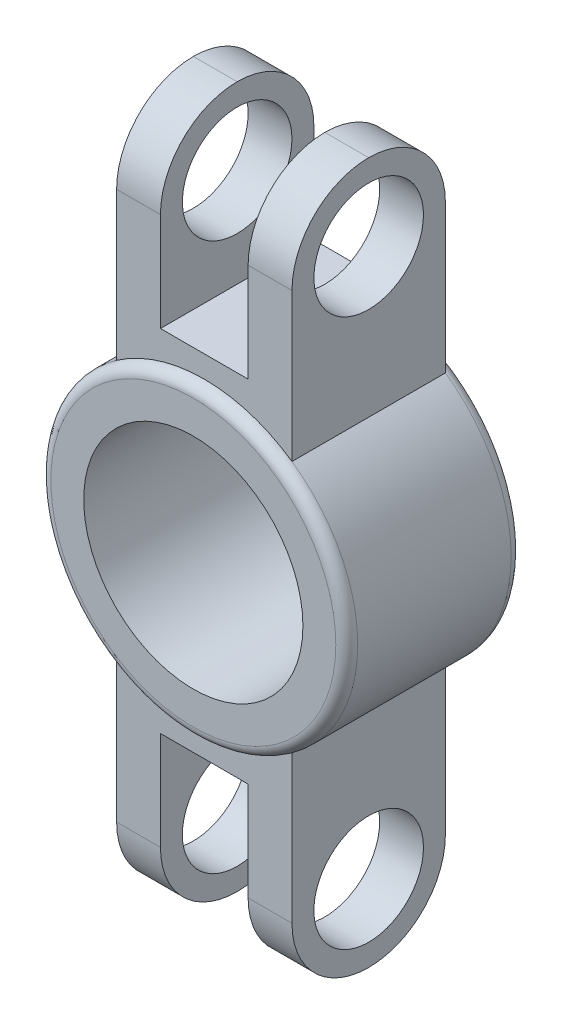
ISO-10303-21;
HEADER;
FILE_DESCRIPTION(('STEP AP214'),'2;1');
FILE_NAME('part.step','',(''),(''),'','','');
FILE_SCHEMA(('AUTOMOTIVE_DESIGN { 1 0 10303 214 1 1 1 1 }'));
ENDSEC;
DATA;
#1=APPLICATION_CONTEXT('core data for automotive mechanical design processes');
#2=APPLICATION_PROTOCOL_DEFINITION('international standard','automotive_design',2000,#1);
#3=PRODUCT_CONTEXT('',#1,'mechanical');
#4=PRODUCT('Part','Part','',(#3));
#5=PRODUCT_RELATED_PRODUCT_CATEGORY('part','',(#4));
#6=PRODUCT_DEFINITION_FORMATION('','',#4);
#7=PRODUCT_DEFINITION_CONTEXT('part definition',#1,'design');
#8=PRODUCT_DEFINITION('design','',#6,#7);
#9=PRODUCT_DEFINITION_SHAPE('','',#8);
#10=(LENGTH_UNIT() NAMED_UNIT(*) SI_UNIT(.MILLI.,.METRE.));
#11=(NAMED_UNIT(*) PLANE_ANGLE_UNIT() SI_UNIT($,.RADIAN.));
#12=(NAMED_UNIT(*) SI_UNIT($,.STERADIAN.) SOLID_ANGLE_UNIT());
#13=UNCERTAINTY_MEASURE_WITH_UNIT(LENGTH_MEASURE(1.E-05),#10,'distance_accuracy_value','');
#14=(GEOMETRIC_REPRESENTATION_CONTEXT(3) GLOBAL_UNCERTAINTY_ASSIGNED_CONTEXT((#13)) GLOBAL_UNIT_ASSIGNED_CONTEXT((#10,
#11,#12)) REPRESENTATION_CONTEXT('',''));
#15=CARTESIAN_POINT('',(0.,0.,0.));
#16=DIRECTION('',(0.,0.,1.));
#17=DIRECTION('',(1.,0.,0.));
#18=AXIS2_PLACEMENT_3D('',#15,#16,#17);
#19=CARTESIAN_POINT('',(5.08,-6.985,4.445));
#20=DIRECTION('',(-1.,0.,0.));
#21=DIRECTION('',(0.,0.,1.));
#22=AXIS2_PLACEMENT_3D('',#19,#20,#21);
#23=PLANE('',#22);
#24=CARTESIAN_POINT('',(5.08,-15.875,0.));
#25=DIRECTION('',(-1.,0.,0.));
#26=DIRECTION('',(0.,0.,1.));
#27=AXIS2_PLACEMENT_3D('',#24,#25,#26);
#28=CIRCLE('',#27,4.445);
#29=CARTESIAN_POINT('',(5.08,-15.875,4.445));
#30=VERTEX_POINT('',#29);
#31=CARTESIAN_POINT('',(5.08,-20.32,0.));
#32=VERTEX_POINT('',#31);
#33=EDGE_CURVE('E44',#30,#32,#28,.F.);
#34=ORIENTED_EDGE('',*,*,#33,.T.);
#35=CARTESIAN_POINT('',(5.08,-15.875,0.));
#36=DIRECTION('',(-1.,0.,0.));
#37=DIRECTION('',(0.,0.,1.));
#38=AXIS2_PLACEMENT_3D('',#35,#36,#37);
#39=CIRCLE('',#38,4.445);
#40=CARTESIAN_POINT('',(5.08,-15.875,-4.445));
#41=VERTEX_POINT('',#40);
#42=EDGE_CURVE('E11',#32,#41,#39,.F.);
#43=ORIENTED_EDGE('',*,*,#42,.T.);
#44=DIRECTION('',(0.,-1.,0.));
#45=VECTOR('',#44,1.);
#46=CARTESIAN_POINT('',(5.08,-6.985,-4.445));
#47=LINE('',#46,#45);
#48=CARTESIAN_POINT('',(5.08,-7.2955945611033,-4.445));
#49=VERTEX_POINT('',#48);
#50=EDGE_CURVE('E193',#49,#41,#47,.T.);
#51=ORIENTED_EDGE('',*,*,#50,.F.);
#52=DIRECTION('',(0.,0.,-1.));
#53=VECTOR('',#52,1.);
#54=CARTESIAN_POINT('',(5.08,-7.2955945611033,5.08));
#55=LINE('',#54,#53);
#56=CARTESIAN_POINT('',(5.08,-7.2955945611033,4.445));
#57=VERTEX_POINT('',#56);
#58=EDGE_CURVE('E192',#49,#57,#55,.F.);
#59=ORIENTED_EDGE('',*,*,#58,.T.);
#60=DIRECTION('',(0.,-1.,0.));
#61=VECTOR('',#60,1.);
#62=CARTESIAN_POINT('',(5.08,-6.985,4.445));
#63=LINE('',#62,#61);
#64=EDGE_CURVE('E199',#57,#30,#63,.T.);
#65=ORIENTED_EDGE('',*,*,#64,.T.);
#66=EDGE_LOOP('',(#34,#43,#51,#59,#65));
#67=FACE_BOUND('',#66,.T.);
#68=CARTESIAN_POINT('',(5.08,-15.875,0.));
#69=DIRECTION('',(-1.,0.,0.));
#70=DIRECTION('',(0.,0.,-1.));
#71=AXIS2_PLACEMENT_3D('',#68,#69,#70);
#72=CIRCLE('',#71,3.175);
#73=CARTESIAN_POINT('',(5.08,-15.875,-3.175));
#74=VERTEX_POINT('',#73);
#75=EDGE_CURVE('E348',#74,#74,#72,.T.);
#76=ORIENTED_EDGE('',*,*,#75,.T.);
#77=EDGE_LOOP('',(#76));
#78=FACE_BOUND('',#77,.T.);
#79=ADVANCED_FACE('F35',(#67,#78),#23,.F.);
#80=CARTESIAN_POINT('',(2.54,-6.985,4.445));
#81=DIRECTION('',(1.,0.,0.));
#82=DIRECTION('',(0.,0.,-1.));
#83=AXIS2_PLACEMENT_3D('',#80,#81,#82);
#84=PLANE('',#83);
#85=DIRECTION('',(0.,-1.,0.));
#86=VECTOR('',#85,1.);
#87=CARTESIAN_POINT('',(2.54,-6.985,-4.445));
#88=LINE('',#87,#86);
#89=CARTESIAN_POINT('',(2.54,-10.16,-4.445));
#90=VERTEX_POINT('',#89);
#91=CARTESIAN_POINT('',(2.54,-15.875,-4.445));
#92=VERTEX_POINT('',#91);
#93=EDGE_CURVE('E198',#90,#92,#88,.T.);
#94=ORIENTED_EDGE('',*,*,#93,.T.);
#95=CARTESIAN_POINT('',(2.54,-15.875,0.));
#96=DIRECTION('',(1.,0.,0.));
#97=DIRECTION('',(0.,0.,-1.));
#98=AXIS2_PLACEMENT_3D('',#95,#96,#97);
#99=CIRCLE('',#98,4.445);
#100=CARTESIAN_POINT('',(2.54,-20.32,0.));
#101=VERTEX_POINT('',#100);
#102=EDGE_CURVE('E58',#92,#101,#99,.F.);
#103=ORIENTED_EDGE('',*,*,#102,.T.);
#104=CARTESIAN_POINT('',(2.54,-15.875,0.));
#105=DIRECTION('',(1.,0.,0.));
#106=DIRECTION('',(0.,0.,-1.));
#107=AXIS2_PLACEMENT_3D('',#104,#105,#106);
#108=CIRCLE('',#107,4.445);
#109=CARTESIAN_POINT('',(2.54,-15.875,4.445));
#110=VERTEX_POINT('',#109);
#111=EDGE_CURVE('E197',#101,#110,#108,.F.);
#112=ORIENTED_EDGE('',*,*,#111,.T.);
#113=DIRECTION('',(0.,-1.,0.));
#114=VECTOR('',#113,1.);
#115=CARTESIAN_POINT('',(2.54,-6.985,4.445));
#116=LINE('',#115,#114);
#117=CARTESIAN_POINT('',(2.54,-10.16,4.445));
#118=VERTEX_POINT('',#117);
#119=EDGE_CURVE('E178',#118,#110,#116,.T.);
#120=ORIENTED_EDGE('',*,*,#119,.F.);
#121=DIRECTION('',(0.,0.,1.));
#122=VECTOR('',#121,1.);
#123=CARTESIAN_POINT('',(2.54,-10.16,4.445));
#124=LINE('',#123,#122);
#125=EDGE_CURVE('E188',#90,#118,#124,.T.);
#126=ORIENTED_EDGE('',*,*,#125,.F.);
#127=EDGE_LOOP('',(#94,#103,#112,#120,#126));
#128=FACE_BOUND('',#127,.T.);
#129=CARTESIAN_POINT('',(2.54,-15.875,0.));
#130=DIRECTION('',(1.,0.,0.));
#131=DIRECTION('',(0.,0.,-1.));
#132=AXIS2_PLACEMENT_3D('',#129,#130,#131);
#133=CIRCLE('',#132,3.175);
#134=CARTESIAN_POINT('',(2.54,-15.875,-3.175));
#135=VERTEX_POINT('',#134);
#136=EDGE_CURVE('E337',#135,#135,#133,.F.);
#137=ORIENTED_EDGE('',*,*,#136,.F.);
#138=EDGE_LOOP('',(#137));
#139=FACE_BOUND('',#138,.T.);
#140=ADVANCED_FACE('F195',(#128,#139),#84,.F.);
#141=CARTESIAN_POINT('',(-5.08,-6.985,4.445));
#142=DIRECTION('',(1.,0.,0.));
#143=DIRECTION('',(0.,0.,-1.));
#144=AXIS2_PLACEMENT_3D('',#141,#142,#143);
#145=PLANE('',#144);
#146=DIRECTION('',(0.,-1.,0.));
#147=VECTOR('',#146,1.);
#148=CARTESIAN_POINT('',(-5.08,-6.985,-4.445));
#149=LINE('',#148,#147);
#150=CARTESIAN_POINT('',(-5.08,-7.29559456110329,-4.445));
#151=VERTEX_POINT('',#150);
#152=CARTESIAN_POINT('',(-5.08,-15.875,-4.445));
#153=VERTEX_POINT('',#152);
#154=EDGE_CURVE('E354',#151,#153,#149,.T.);
#155=ORIENTED_EDGE('',*,*,#154,.T.);
#156=CARTESIAN_POINT('',(-5.08,-15.875,0.));
#157=DIRECTION('',(1.,0.,0.));
#158=DIRECTION('',(0.,0.,-1.));
#159=AXIS2_PLACEMENT_3D('',#156,#157,#158);
#160=CIRCLE('',#159,4.445);
#161=CARTESIAN_POINT('',(-5.08,-20.32,0.));
#162=VERTEX_POINT('',#161);
#163=EDGE_CURVE('E320',#153,#162,#160,.F.);
#164=ORIENTED_EDGE('',*,*,#163,.T.);
#165=CARTESIAN_POINT('',(-5.08,-15.875,0.));
#166=DIRECTION('',(1.,0.,0.));
#167=DIRECTION('',(0.,0.,-1.));
#168=AXIS2_PLACEMENT_3D('',#165,#166,#167);
#169=CIRCLE('',#168,4.445);
#170=CARTESIAN_POINT('',(-5.08,-15.875,4.445));
#171=VERTEX_POINT('',#170);
#172=EDGE_CURVE('E318',#162,#171,#169,.F.);
#173=ORIENTED_EDGE('',*,*,#172,.T.);
#174=DIRECTION('',(0.,-1.,0.));
#175=VECTOR('',#174,1.);
#176=CARTESIAN_POINT('',(-5.08,-6.985,4.445));
#177=LINE('',#176,#175);
#178=CARTESIAN_POINT('',(-5.08,-7.29559456110329,4.445));
#179=VERTEX_POINT('',#178);
#180=EDGE_CURVE('E357',#179,#171,#177,.T.);
#181=ORIENTED_EDGE('',*,*,#180,.F.);
#182=DIRECTION('',(0.,0.,-1.));
#183=VECTOR('',#182,1.);
#184=CARTESIAN_POINT('',(-5.08,-7.29559456110329,5.08));
#185=LINE('',#184,#183);
#186=EDGE_CURVE('E202',#179,#151,#185,.T.);
#187=ORIENTED_EDGE('',*,*,#186,.T.);
#188=EDGE_LOOP('',(#155,#164,#173,#181,#187));
#189=FACE_BOUND('',#188,.T.);
#190=CARTESIAN_POINT('',(-5.08,-15.875,0.));
#191=DIRECTION('',(-1.,0.,0.));
#192=DIRECTION('',(0.,0.,-1.));
#193=AXIS2_PLACEMENT_3D('',#190,#191,#192);
#194=CIRCLE('',#193,3.175);
#195=CARTESIAN_POINT('',(-5.08,-15.875,-3.175));
#196=VERTEX_POINT('',#195);
#197=EDGE_CURVE('E345',#196,#196,#194,.T.);
#198=ORIENTED_EDGE('',*,*,#197,.F.);
#199=EDGE_LOOP('',(#198));
#200=FACE_BOUND('',#199,.T.);
#201=ADVANCED_FACE('F383',(#189,#200),#145,.F.);
#202=CARTESIAN_POINT('',(-2.54,-6.985,4.445));
#203=DIRECTION('',(-1.,0.,0.));
#204=DIRECTION('',(0.,0.,1.));
#205=AXIS2_PLACEMENT_3D('',#202,#203,#204);
#206=PLANE('',#205);
#207=CARTESIAN_POINT('',(-2.54,-15.875,0.));
#208=DIRECTION('',(-1.,0.,0.));
#209=DIRECTION('',(0.,0.,1.));
#210=AXIS2_PLACEMENT_3D('',#207,#208,#209);
#211=CIRCLE('',#210,4.445);
#212=CARTESIAN_POINT('',(-2.54,-15.875,4.445));
#213=VERTEX_POINT('',#212);
#214=CARTESIAN_POINT('',(-2.54,-20.32,0.));
#215=VERTEX_POINT('',#214);
#216=EDGE_CURVE('E322',#213,#215,#211,.F.);
#217=ORIENTED_EDGE('',*,*,#216,.T.);
#218=CARTESIAN_POINT('',(-2.54,-15.875,0.));
#219=DIRECTION('',(-1.,0.,0.));
#220=DIRECTION('',(0.,0.,1.));
#221=AXIS2_PLACEMENT_3D('',#218,#219,#220);
#222=CIRCLE('',#221,4.445);
#223=CARTESIAN_POINT('',(-2.54,-15.875,-4.445));
#224=VERTEX_POINT('',#223);
#225=EDGE_CURVE('E324',#215,#224,#222,.F.);
#226=ORIENTED_EDGE('',*,*,#225,.T.);
#227=DIRECTION('',(0.,-1.,0.));
#228=VECTOR('',#227,1.);
#229=CARTESIAN_POINT('',(-2.54,-6.985,-4.445));
#230=LINE('',#229,#228);
#231=CARTESIAN_POINT('',(-2.54,-10.16,-4.445));
#232=VERTEX_POINT('',#231);
#233=EDGE_CURVE('E350',#232,#224,#230,.T.);
#234=ORIENTED_EDGE('',*,*,#233,.F.);
#235=DIRECTION('',(0.,0.,-1.));
#236=VECTOR('',#235,1.);
#237=CARTESIAN_POINT('',(-2.54,-10.16,4.445));
#238=LINE('',#237,#236);
#239=CARTESIAN_POINT('',(-2.54,-10.16,4.445));
#240=VERTEX_POINT('',#239);
#241=EDGE_CURVE('E353',#240,#232,#238,.T.);
#242=ORIENTED_EDGE('',*,*,#241,.F.);
#243=DIRECTION('',(0.,-1.,0.));
#244=VECTOR('',#243,1.);
#245=CARTESIAN_POINT('',(-2.54,-6.985,4.445));
#246=LINE('',#245,#244);
#247=EDGE_CURVE('E181',#240,#213,#246,.T.);
#248=ORIENTED_EDGE('',*,*,#247,.T.);
#249=EDGE_LOOP('',(#217,#226,#234,#242,#248));
#250=FACE_BOUND('',#249,.T.);
#251=CARTESIAN_POINT('',(-2.54,-15.875,0.));
#252=DIRECTION('',(-1.,0.,0.));
#253=DIRECTION('',(0.,0.,1.));
#254=AXIS2_PLACEMENT_3D('',#251,#252,#253);
#255=CIRCLE('',#254,3.175);
#256=CARTESIAN_POINT('',(-2.54,-15.875,3.175));
#257=VERTEX_POINT('',#256);
#258=EDGE_CURVE('E39',#257,#257,#255,.F.);
#259=ORIENTED_EDGE('',*,*,#258,.F.);
#260=EDGE_LOOP('',(#259));
#261=FACE_BOUND('',#260,.T.);
#262=ADVANCED_FACE('F385',(#250,#261),#206,.F.);
#263=CARTESIAN_POINT('',(3.81,-10.16,4.445));
#264=DIRECTION('',(0.,-1.,0.));
#265=DIRECTION('',(0.,0.,-1.));
#266=AXIS2_PLACEMENT_3D('',#263,#264,#265);
#267=PLANE('',#266);
#268=DIRECTION('',(-1.,0.,0.));
#269=VECTOR('',#268,1.);
#270=CARTESIAN_POINT('',(3.81,-10.16,4.445));
#271=LINE('',#270,#269);
#272=EDGE_CURVE('E173',#118,#240,#271,.T.);
#273=ORIENTED_EDGE('',*,*,#272,.T.);
#274=ORIENTED_EDGE('',*,*,#241,.T.);
#275=DIRECTION('',(-1.,0.,0.));
#276=VECTOR('',#275,1.);
#277=CARTESIAN_POINT('',(3.81,-10.16,-4.445));
#278=LINE('',#277,#276);
#279=EDGE_CURVE('E185',#90,#232,#278,.T.);
#280=ORIENTED_EDGE('',*,*,#279,.F.);
#281=ORIENTED_EDGE('',*,*,#125,.T.);
#282=EDGE_LOOP('',(#273,#274,#280,#281));
#283=FACE_BOUND('',#282,.T.);
#284=ADVANCED_FACE('F189',(#283),#267,.T.);
#285=CARTESIAN_POINT('',(0.,0.,5.08));
#286=DIRECTION('',(0.,0.,-1.));
#287=DIRECTION('',(-1.,0.,0.));
#288=AXIS2_PLACEMENT_3D('',#285,#286,#287);
#289=CYLINDRICAL_SURFACE('',#288,8.89);
#290=ORIENTED_EDGE('',*,*,#186,.F.);
#291=CARTESIAN_POINT('',(0.,0.,4.445));
#292=DIRECTION('',(0.,0.,1.));
#293=DIRECTION('',(1.,0.,0.));
#294=AXIS2_PLACEMENT_3D('',#291,#292,#293);
#295=CIRCLE('',#294,8.89);
#296=CARTESIAN_POINT('',(-5.08,7.29559456110329,4.445));
#297=VERTEX_POINT('',#296);
#298=EDGE_CURVE('E259',#179,#297,#295,.F.);
#299=ORIENTED_EDGE('',*,*,#298,.T.);
#300=DIRECTION('',(0.,0.,-1.));
#301=VECTOR('',#300,1.);
#302=CARTESIAN_POINT('',(-5.08,7.29559456110329,5.08));
#303=LINE('',#302,#301);
#304=CARTESIAN_POINT('',(-5.08,7.29559456110329,-4.445));
#305=VERTEX_POINT('',#304);
#306=EDGE_CURVE('E222',#297,#305,#303,.T.);
#307=ORIENTED_EDGE('',*,*,#306,.T.);
#308=CARTESIAN_POINT('',(0.,0.,-4.445));
#309=DIRECTION('',(0.,0.,1.));
#310=DIRECTION('',(1.,0.,0.));
#311=AXIS2_PLACEMENT_3D('',#308,#309,#310);
#312=CIRCLE('',#311,8.89);
#313=EDGE_CURVE('E269',#305,#151,#312,.T.);
#314=ORIENTED_EDGE('',*,*,#313,.T.);
#315=EDGE_LOOP('',(#290,#299,#307,#314));
#316=FACE_BOUND('',#315,.T.);
#317=ADVANCED_FACE('F403',(#316),#289,.T.);
#318=ORIENTED_EDGE('',*,*,#58,.F.);
#319=CARTESIAN_POINT('',(5.08,7.2955945611033,-4.445));
#320=VERTEX_POINT('',#319);
#321=EDGE_CURVE('E264',#49,#320,#312,.T.);
#322=ORIENTED_EDGE('',*,*,#321,.T.);
#323=DIRECTION('',(0.,0.,-1.));
#324=VECTOR('',#323,1.);
#325=CARTESIAN_POINT('',(5.08,7.2955945611033,5.08));
#326=LINE('',#325,#324);
#327=CARTESIAN_POINT('',(5.08,7.2955945611033,4.445));
#328=VERTEX_POINT('',#327);
#329=EDGE_CURVE('E239',#320,#328,#326,.F.);
#330=ORIENTED_EDGE('',*,*,#329,.T.);
#331=EDGE_CURVE('E265',#328,#57,#295,.F.);
#332=ORIENTED_EDGE('',*,*,#331,.T.);
#333=EDGE_LOOP('',(#318,#322,#330,#332));
#334=FACE_BOUND('',#333,.T.);
#335=ADVANCED_FACE('F451',(#334),#289,.T.);
#336=CARTESIAN_POINT('',(0.,0.,5.08));
#337=DIRECTION('',(0.,0.,1.));
#338=DIRECTION('',(1.,0.,0.));
#339=AXIS2_PLACEMENT_3D('',#336,#337,#338);
#340=PLANE('',#339);
#341=CARTESIAN_POINT('',(0.,0.,5.08));
#342=DIRECTION('',(0.,0.,1.));
#343=DIRECTION('',(1.,0.,0.));
#344=AXIS2_PLACEMENT_3D('',#341,#342,#343);
#345=CIRCLE('',#344,8.255);
#346=CARTESIAN_POINT('',(8.255,0.,5.08));
#347=VERTEX_POINT('',#346);
#348=EDGE_CURVE('E272',#347,#347,#345,.T.);
#349=ORIENTED_EDGE('',*,*,#348,.T.);
#350=EDGE_LOOP('',(#349));
#351=FACE_BOUND('',#350,.T.);
#352=CARTESIAN_POINT('',(0.,0.,5.08));
#353=DIRECTION('',(0.,0.,1.));
#354=DIRECTION('',(1.,0.,0.));
#355=AXIS2_PLACEMENT_3D('',#352,#353,#354);
#356=CIRCLE('',#355,6.35);
#357=CARTESIAN_POINT('',(6.35,0.,5.08));
#358=VERTEX_POINT('',#357);
#359=EDGE_CURVE('E256',#358,#358,#356,.T.);
#360=ORIENTED_EDGE('',*,*,#359,.F.);
#361=EDGE_LOOP('',(#360));
#362=FACE_BOUND('',#361,.T.);
#363=ADVANCED_FACE('F448',(#351,#362),#340,.T.);
#364=CARTESIAN_POINT('',(0.,0.,-5.08));
#365=DIRECTION('',(0.,0.,1.));
#366=DIRECTION('',(1.,0.,0.));
#367=AXIS2_PLACEMENT_3D('',#364,#365,#366);
#368=PLANE('',#367);
#369=CARTESIAN_POINT('',(0.,0.,-5.08));
#370=DIRECTION('',(0.,0.,1.));
#371=DIRECTION('',(1.,0.,0.));
#372=AXIS2_PLACEMENT_3D('',#369,#370,#371);
#373=CIRCLE('',#372,8.255);
#374=CARTESIAN_POINT('',(8.255,0.,-5.08));
#375=VERTEX_POINT('',#374);
#376=EDGE_CURVE('E268',#375,#375,#373,.F.);
#377=ORIENTED_EDGE('',*,*,#376,.T.);
#378=EDGE_LOOP('',(#377));
#379=FACE_BOUND('',#378,.T.);
#380=CARTESIAN_POINT('',(0.,0.,-5.08));
#381=DIRECTION('',(0.,0.,1.));
#382=DIRECTION('',(1.,0.,0.));
#383=AXIS2_PLACEMENT_3D('',#380,#381,#382);
#384=CIRCLE('',#383,6.35);
#385=CARTESIAN_POINT('',(6.35,0.,-5.08));
#386=VERTEX_POINT('',#385);
#387=EDGE_CURVE('E255',#386,#386,#384,.T.);
#388=ORIENTED_EDGE('',*,*,#387,.T.);
#389=EDGE_LOOP('',(#388));
#390=FACE_BOUND('',#389,.T.);
#391=ADVANCED_FACE('F446',(#379,#390),#368,.F.);
#392=CARTESIAN_POINT('',(0.,0.,5.08));
#393=DIRECTION('',(0.,0.,-1.));
#394=DIRECTION('',(-1.,0.,0.));
#395=AXIS2_PLACEMENT_3D('',#392,#393,#394);
#396=CYLINDRICAL_SURFACE('',#395,6.35);
#397=ORIENTED_EDGE('',*,*,#359,.T.);
#398=EDGE_LOOP('',(#397));
#399=FACE_BOUND('',#398,.T.);
#400=ORIENTED_EDGE('',*,*,#387,.F.);
#401=EDGE_LOOP('',(#400));
#402=FACE_BOUND('',#401,.T.);
#403=ADVANCED_FACE('F442',(#399,#402),#396,.F.);
#404=CARTESIAN_POINT('',(0.,0.,-4.445));
#405=DIRECTION('',(0.,0.,1.));
#406=DIRECTION('',(1.,0.,0.));
#407=AXIS2_PLACEMENT_3D('',#404,#405,#406);
#408=TOROIDAL_SURFACE('',#407,8.255,0.635);
#409=ORIENTED_EDGE('',*,*,#376,.F.);
#410=EDGE_LOOP('',(#409));
#411=FACE_BOUND('',#410,.T.);
#412=EDGE_CURVE('E266',#320,#305,#312,.T.);
#413=ORIENTED_EDGE('',*,*,#412,.F.);
#414=ORIENTED_EDGE('',*,*,#321,.F.);
#415=EDGE_CURVE('E368',#151,#49,#312,.T.);
#416=ORIENTED_EDGE('',*,*,#415,.F.);
#417=ORIENTED_EDGE('',*,*,#313,.F.);
#418=EDGE_LOOP('',(#413,#414,#416,#417));
#419=FACE_BOUND('',#418,.T.);
#420=ADVANCED_FACE('F445',(#411,#419),#408,.T.);
#421=CARTESIAN_POINT('',(0.,0.,4.445));
#422=DIRECTION('',(0.,0.,1.));
#423=DIRECTION('',(1.,0.,0.));
#424=AXIS2_PLACEMENT_3D('',#421,#422,#423);
#425=TOROIDAL_SURFACE('',#424,8.255,0.635);
#426=EDGE_CURVE('E262',#297,#328,#295,.F.);
#427=ORIENTED_EDGE('',*,*,#426,.F.);
#428=ORIENTED_EDGE('',*,*,#298,.F.);
#429=EDGE_CURVE('E517',#57,#179,#295,.F.);
#430=ORIENTED_EDGE('',*,*,#429,.F.);
#431=ORIENTED_EDGE('',*,*,#331,.F.);
#432=EDGE_LOOP('',(#427,#428,#430,#431));
#433=FACE_BOUND('',#432,.T.);
#434=ORIENTED_EDGE('',*,*,#348,.F.);
#435=EDGE_LOOP('',(#434));
#436=FACE_BOUND('',#435,.T.);
#437=ADVANCED_FACE('F440',(#433,#436),#425,.T.);
#438=CARTESIAN_POINT('',(3.81,6.35,4.445));
#439=DIRECTION('',(0.,0.,-1.));
#440=DIRECTION('',(-1.,0.,0.));
#441=AXIS2_PLACEMENT_3D('',#438,#439,#440);
#442=PLANE('',#441);
#443=DIRECTION('',(0.,1.,0.));
#444=VECTOR('',#443,1.);
#445=CARTESIAN_POINT('',(-2.54,6.985,4.445));
#446=LINE('',#445,#444);
#447=CARTESIAN_POINT('',(-2.54,10.16,4.445));
#448=VERTEX_POINT('',#447);
#449=CARTESIAN_POINT('',(-2.54,15.875,4.445));
#450=VERTEX_POINT('',#449);
#451=EDGE_CURVE('E219',#448,#450,#446,.T.);
#452=ORIENTED_EDGE('',*,*,#451,.T.);
#453=DIRECTION('',(1.,0.,0.));
#454=VECTOR('',#453,1.);
#455=CARTESIAN_POINT('',(3.81,15.875,4.445));
#456=LINE('',#455,#454);
#457=CARTESIAN_POINT('',(-5.08,15.875,4.445));
#458=VERTEX_POINT('',#457);
#459=EDGE_CURVE('E296',#450,#458,#456,.F.);
#460=ORIENTED_EDGE('',*,*,#459,.T.);
#461=DIRECTION('',(0.,1.,0.));
#462=VECTOR('',#461,1.);
#463=CARTESIAN_POINT('',(-5.08,6.985,4.445));
#464=LINE('',#463,#462);
#465=EDGE_CURVE('E223',#297,#458,#464,.T.);
#466=ORIENTED_EDGE('',*,*,#465,.F.);
#467=ORIENTED_EDGE('',*,*,#426,.T.);
#468=DIRECTION('',(0.,1.,0.));
#469=VECTOR('',#468,1.);
#470=CARTESIAN_POINT('',(5.08,6.985,4.445));
#471=LINE('',#470,#469);
#472=CARTESIAN_POINT('',(5.08,15.875,4.445));
#473=VERTEX_POINT('',#472);
#474=EDGE_CURVE('E236',#328,#473,#471,.T.);
#475=ORIENTED_EDGE('',*,*,#474,.T.);
#476=DIRECTION('',(1.,0.,0.));
#477=VECTOR('',#476,1.);
#478=CARTESIAN_POINT('',(3.81,15.875,4.445));
#479=LINE('',#478,#477);
#480=CARTESIAN_POINT('',(2.54,15.875,4.445));
#481=VERTEX_POINT('',#480);
#482=EDGE_CURVE('E294',#473,#481,#479,.F.);
#483=ORIENTED_EDGE('',*,*,#482,.T.);
#484=DIRECTION('',(0.,1.,0.));
#485=VECTOR('',#484,1.);
#486=CARTESIAN_POINT('',(2.54,6.985,4.445));
#487=LINE('',#486,#485);
#488=CARTESIAN_POINT('',(2.54,10.16,4.445));
#489=VERTEX_POINT('',#488);
#490=EDGE_CURVE('E240',#489,#481,#487,.T.);
#491=ORIENTED_EDGE('',*,*,#490,.F.);
#492=DIRECTION('',(-1.,0.,0.));
#493=VECTOR('',#492,1.);
#494=CARTESIAN_POINT('',(3.81,10.16,4.445));
#495=LINE('',#494,#493);
#496=EDGE_CURVE('E250',#489,#448,#495,.T.);
#497=ORIENTED_EDGE('',*,*,#496,.T.);
#498=EDGE_LOOP('',(#452,#460,#466,#467,#475,#483,#491,#497));
#499=FACE_BOUND('',#498,.T.);
#500=ADVANCED_FACE('F436',(#499),#442,.F.);
#501=CARTESIAN_POINT('',(3.81,6.35,-4.445));
#502=DIRECTION('',(0.,0.,1.));
#503=DIRECTION('',(1.,0.,0.));
#504=AXIS2_PLACEMENT_3D('',#501,#502,#503);
#505=PLANE('',#504);
#506=DIRECTION('',(0.,1.,0.));
#507=VECTOR('',#506,1.);
#508=CARTESIAN_POINT('',(-5.08,6.985,-4.445));
#509=LINE('',#508,#507);
#510=CARTESIAN_POINT('',(-5.08,15.875,-4.445));
#511=VERTEX_POINT('',#510);
#512=EDGE_CURVE('E226',#305,#511,#509,.T.);
#513=ORIENTED_EDGE('',*,*,#512,.T.);
#514=DIRECTION('',(-1.,0.,0.));
#515=VECTOR('',#514,1.);
#516=CARTESIAN_POINT('',(3.81,15.875,-4.445));
#517=LINE('',#516,#515);
#518=CARTESIAN_POINT('',(-2.54,15.875,-4.445));
#519=VERTEX_POINT('',#518);
#520=EDGE_CURVE('E287',#511,#519,#517,.F.);
#521=ORIENTED_EDGE('',*,*,#520,.T.);
#522=DIRECTION('',(0.,1.,0.));
#523=VECTOR('',#522,1.);
#524=CARTESIAN_POINT('',(-2.54,6.985,-4.445));
#525=LINE('',#524,#523);
#526=CARTESIAN_POINT('',(-2.54,10.16,-4.445));
#527=VERTEX_POINT('',#526);
#528=EDGE_CURVE('E229',#527,#519,#525,.T.);
#529=ORIENTED_EDGE('',*,*,#528,.F.);
#530=DIRECTION('',(-1.,0.,0.));
#531=VECTOR('',#530,1.);
#532=CARTESIAN_POINT('',(3.81,10.16,-4.445));
#533=LINE('',#532,#531);
#534=CARTESIAN_POINT('',(2.54,10.16,-4.445));
#535=VERTEX_POINT('',#534);
#536=EDGE_CURVE('E253',#535,#527,#533,.T.);
#537=ORIENTED_EDGE('',*,*,#536,.F.);
#538=DIRECTION('',(0.,1.,0.));
#539=VECTOR('',#538,1.);
#540=CARTESIAN_POINT('',(2.54,6.985,-4.445));
#541=LINE('',#540,#539);
#542=CARTESIAN_POINT('',(2.54,15.875,-4.445));
#543=VERTEX_POINT('',#542);
#544=EDGE_CURVE('E243',#535,#543,#541,.T.);
#545=ORIENTED_EDGE('',*,*,#544,.T.);
#546=DIRECTION('',(-1.,0.,0.));
#547=VECTOR('',#546,1.);
#548=CARTESIAN_POINT('',(3.81,15.875,-4.445));
#549=LINE('',#548,#547);
#550=CARTESIAN_POINT('',(5.08,15.875,-4.445));
#551=VERTEX_POINT('',#550);
#552=EDGE_CURVE('E284',#543,#551,#549,.F.);
#553=ORIENTED_EDGE('',*,*,#552,.T.);
#554=DIRECTION('',(0.,1.,0.));
#555=VECTOR('',#554,1.);
#556=CARTESIAN_POINT('',(5.08,6.985,-4.445));
#557=LINE('',#556,#555);
#558=EDGE_CURVE('E235',#320,#551,#557,.T.);
#559=ORIENTED_EDGE('',*,*,#558,.F.);
#560=ORIENTED_EDGE('',*,*,#412,.T.);
#561=EDGE_LOOP('',(#513,#521,#529,#537,#545,#553,#559,#560));
#562=FACE_BOUND('',#561,.T.);
#563=ADVANCED_FACE('F432',(#562),#505,.F.);
#564=CARTESIAN_POINT('',(3.81,10.16,4.445));
#565=DIRECTION('',(0.,-1.,0.));
#566=DIRECTION('',(0.,0.,-1.));
#567=AXIS2_PLACEMENT_3D('',#564,#565,#566);
#568=PLANE('',#567);
#569=ORIENTED_EDGE('',*,*,#536,.T.);
#570=DIRECTION('',(0.,0.,1.));
#571=VECTOR('',#570,1.);
#572=CARTESIAN_POINT('',(-2.54,10.16,4.445));
#573=LINE('',#572,#571);
#574=EDGE_CURVE('E278',#527,#448,#573,.T.);
#575=ORIENTED_EDGE('',*,*,#574,.T.);
#576=ORIENTED_EDGE('',*,*,#496,.F.);
#577=DIRECTION('',(0.,0.,-1.));
#578=VECTOR('',#577,1.);
#579=CARTESIAN_POINT('',(2.54,10.16,4.445));
#580=LINE('',#579,#578);
#581=EDGE_CURVE('E275',#489,#535,#580,.T.);
#582=ORIENTED_EDGE('',*,*,#581,.T.);
#583=EDGE_LOOP('',(#569,#575,#576,#582));
#584=FACE_BOUND('',#583,.T.);
#585=ADVANCED_FACE('F428',(#584),#568,.F.);
#586=CARTESIAN_POINT('',(5.08,6.985,4.445));
#587=DIRECTION('',(1.,0.,0.));
#588=DIRECTION('',(0.,0.,-1.));
#589=AXIS2_PLACEMENT_3D('',#586,#587,#588);
#590=PLANE('',#589);
#591=CARTESIAN_POINT('',(5.08,15.875,0.));
#592=DIRECTION('',(1.,0.,0.));
#593=DIRECTION('',(0.,0.,-1.));
#594=AXIS2_PLACEMENT_3D('',#591,#592,#593);
#595=CIRCLE('',#594,3.175);
#596=CARTESIAN_POINT('',(5.08,15.875,-3.175));
#597=VERTEX_POINT('',#596);
#598=EDGE_CURVE('E184',#597,#597,#595,.T.);
#599=ORIENTED_EDGE('',*,*,#598,.F.);
#600=EDGE_LOOP('',(#599));
#601=FACE_BOUND('',#600,.T.);
#602=ORIENTED_EDGE('',*,*,#558,.T.);
#603=CARTESIAN_POINT('',(5.08,15.875,0.));
#604=DIRECTION('',(1.,0.,0.));
#605=DIRECTION('',(0.,0.,-1.));
#606=AXIS2_PLACEMENT_3D('',#603,#604,#605);
#607=CIRCLE('',#606,4.445);
#608=CARTESIAN_POINT('',(5.08,20.32,0.));
#609=VERTEX_POINT('',#608);
#610=EDGE_CURVE('E304',#551,#609,#607,.T.);
#611=ORIENTED_EDGE('',*,*,#610,.T.);
#612=CARTESIAN_POINT('',(5.08,15.875,0.));
#613=DIRECTION('',(1.,0.,0.));
#614=DIRECTION('',(0.,0.,-1.));
#615=AXIS2_PLACEMENT_3D('',#612,#613,#614);
#616=CIRCLE('',#615,4.445);
#617=EDGE_CURVE('E302',#609,#473,#616,.T.);
#618=ORIENTED_EDGE('',*,*,#617,.T.);
#619=ORIENTED_EDGE('',*,*,#474,.F.);
#620=ORIENTED_EDGE('',*,*,#329,.F.);
#621=EDGE_LOOP('',(#602,#611,#618,#619,#620));
#622=FACE_BOUND('',#621,.T.);
#623=ADVANCED_FACE('F424',(#601,#622),#590,.T.);
#624=CARTESIAN_POINT('',(2.54,6.985,4.445));
#625=DIRECTION('',(-1.,0.,0.));
#626=DIRECTION('',(0.,0.,1.));
#627=AXIS2_PLACEMENT_3D('',#624,#625,#626);
#628=PLANE('',#627);
#629=CARTESIAN_POINT('',(2.54,15.875,0.));
#630=DIRECTION('',(-1.,0.,0.));
#631=DIRECTION('',(0.,0.,1.));
#632=AXIS2_PLACEMENT_3D('',#629,#630,#631);
#633=CIRCLE('',#632,3.175);
#634=CARTESIAN_POINT('',(2.54,15.875,3.175));
#635=VERTEX_POINT('',#634);
#636=EDGE_CURVE('E215',#635,#635,#633,.T.);
#637=ORIENTED_EDGE('',*,*,#636,.F.);
#638=EDGE_LOOP('',(#637));
#639=FACE_BOUND('',#638,.T.);
#640=CARTESIAN_POINT('',(2.54,15.875,0.));
#641=DIRECTION('',(-1.,0.,0.));
#642=DIRECTION('',(0.,0.,1.));
#643=AXIS2_PLACEMENT_3D('',#640,#641,#642);
#644=CIRCLE('',#643,4.445);
#645=CARTESIAN_POINT('',(2.54,20.32,0.));
#646=VERTEX_POINT('',#645);
#647=EDGE_CURVE('E298',#481,#646,#644,.T.);
#648=ORIENTED_EDGE('',*,*,#647,.T.);
#649=CARTESIAN_POINT('',(2.54,15.875,0.));
#650=DIRECTION('',(-1.,0.,0.));
#651=DIRECTION('',(0.,0.,1.));
#652=AXIS2_PLACEMENT_3D('',#649,#650,#651);
#653=CIRCLE('',#652,4.445);
#654=EDGE_CURVE('E300',#646,#543,#653,.T.);
#655=ORIENTED_EDGE('',*,*,#654,.T.);
#656=ORIENTED_EDGE('',*,*,#544,.F.);
#657=ORIENTED_EDGE('',*,*,#581,.F.);
#658=ORIENTED_EDGE('',*,*,#490,.T.);
#659=EDGE_LOOP('',(#648,#655,#656,#657,#658));
#660=FACE_BOUND('',#659,.T.);
#661=ADVANCED_FACE('F416',(#639,#660),#628,.T.);
#662=CARTESIAN_POINT('',(-5.08,6.985,4.445));
#663=DIRECTION('',(-1.,0.,0.));
#664=DIRECTION('',(0.,0.,1.));
#665=AXIS2_PLACEMENT_3D('',#662,#663,#664);
#666=PLANE('',#665);
#667=CARTESIAN_POINT('',(-5.08,15.875,0.));
#668=DIRECTION('',(1.,0.,0.));
#669=DIRECTION('',(0.,0.,-1.));
#670=AXIS2_PLACEMENT_3D('',#667,#668,#669);
#671=CIRCLE('',#670,3.175);
#672=CARTESIAN_POINT('',(-5.08,15.875,-3.175));
#673=VERTEX_POINT('',#672);
#674=EDGE_CURVE('E209',#673,#673,#671,.T.);
#675=ORIENTED_EDGE('',*,*,#674,.T.);
#676=EDGE_LOOP('',(#675));
#677=FACE_BOUND('',#676,.T.);
#678=CARTESIAN_POINT('',(-5.08,15.875,0.));
#679=DIRECTION('',(-1.,0.,0.));
#680=DIRECTION('',(0.,0.,1.));
#681=AXIS2_PLACEMENT_3D('',#678,#679,#680);
#682=CIRCLE('',#681,4.445);
#683=CARTESIAN_POINT('',(-5.08,20.32,0.));
#684=VERTEX_POINT('',#683);
#685=EDGE_CURVE('E280',#458,#684,#682,.T.);
#686=ORIENTED_EDGE('',*,*,#685,.T.);
#687=CARTESIAN_POINT('',(-5.08,15.875,0.));
#688=DIRECTION('',(-1.,0.,0.));
#689=DIRECTION('',(0.,0.,1.));
#690=AXIS2_PLACEMENT_3D('',#687,#688,#689);
#691=CIRCLE('',#690,4.445);
#692=EDGE_CURVE('E282',#684,#511,#691,.T.);
#693=ORIENTED_EDGE('',*,*,#692,.T.);
#694=ORIENTED_EDGE('',*,*,#512,.F.);
#695=ORIENTED_EDGE('',*,*,#306,.F.);
#696=ORIENTED_EDGE('',*,*,#465,.T.);
#697=EDGE_LOOP('',(#686,#693,#694,#695,#696));
#698=FACE_BOUND('',#697,.T.);
#699=ADVANCED_FACE('F412',(#677,#698),#666,.T.);
#700=CARTESIAN_POINT('',(-2.54,6.985,4.445));
#701=DIRECTION('',(1.,0.,0.));
#702=DIRECTION('',(0.,0.,-1.));
#703=AXIS2_PLACEMENT_3D('',#700,#701,#702);
#704=PLANE('',#703);
#705=CARTESIAN_POINT('',(-2.54,15.875,0.));
#706=DIRECTION('',(1.,0.,0.));
#707=DIRECTION('',(0.,0.,-1.));
#708=AXIS2_PLACEMENT_3D('',#705,#706,#707);
#709=CIRCLE('',#708,3.175);
#710=CARTESIAN_POINT('',(-2.54,15.875,-3.175));
#711=VERTEX_POINT('',#710);
#712=EDGE_CURVE('E212',#711,#711,#709,.T.);
#713=ORIENTED_EDGE('',*,*,#712,.F.);
#714=EDGE_LOOP('',(#713));
#715=FACE_BOUND('',#714,.T.);
#716=ORIENTED_EDGE('',*,*,#528,.T.);
#717=CARTESIAN_POINT('',(-2.54,15.875,0.));
#718=DIRECTION('',(1.,0.,0.));
#719=DIRECTION('',(0.,0.,-1.));
#720=AXIS2_PLACEMENT_3D('',#717,#718,#719);
#721=CIRCLE('',#720,4.445);
#722=CARTESIAN_POINT('',(-2.54,20.32,0.));
#723=VERTEX_POINT('',#722);
#724=EDGE_CURVE('E292',#519,#723,#721,.T.);
#725=ORIENTED_EDGE('',*,*,#724,.T.);
#726=CARTESIAN_POINT('',(-2.54,15.875,0.));
#727=DIRECTION('',(1.,0.,0.));
#728=DIRECTION('',(0.,0.,-1.));
#729=AXIS2_PLACEMENT_3D('',#726,#727,#728);
#730=CIRCLE('',#729,4.445);
#731=EDGE_CURVE('E290',#723,#450,#730,.T.);
#732=ORIENTED_EDGE('',*,*,#731,.T.);
#733=ORIENTED_EDGE('',*,*,#451,.F.);
#734=ORIENTED_EDGE('',*,*,#574,.F.);
#735=EDGE_LOOP('',(#716,#725,#732,#733,#734));
#736=FACE_BOUND('',#735,.T.);
#737=ADVANCED_FACE('F415',(#715,#736),#704,.T.);
#738=CARTESIAN_POINT('',(0.,15.875,0.));
#739=DIRECTION('',(1.,0.,0.));
#740=DIRECTION('',(0.,0.,-1.));
#741=AXIS2_PLACEMENT_3D('',#738,#739,#740);
#742=CYLINDRICAL_SURFACE('',#741,4.445);
#743=ORIENTED_EDGE('',*,*,#459,.F.);
#744=ORIENTED_EDGE('',*,*,#731,.F.);
#745=DIRECTION('',(1.,0.,0.));
#746=VECTOR('',#745,1.);
#747=CARTESIAN_POINT('',(0.,20.32,0.));
#748=LINE('',#747,#746);
#749=EDGE_CURVE('E232',#684,#723,#748,.T.);
#750=ORIENTED_EDGE('',*,*,#749,.F.);
#751=ORIENTED_EDGE('',*,*,#685,.F.);
#752=EDGE_LOOP('',(#743,#744,#750,#751));
#753=FACE_BOUND('',#752,.T.);
#754=ADVANCED_FACE('F420',(#753),#742,.T.);
#755=CARTESIAN_POINT('',(0.,15.875,0.));
#756=DIRECTION('',(-1.,0.,0.));
#757=DIRECTION('',(0.,0.,1.));
#758=AXIS2_PLACEMENT_3D('',#755,#756,#757);
#759=CYLINDRICAL_SURFACE('',#758,4.445);
#760=ORIENTED_EDGE('',*,*,#724,.F.);
#761=ORIENTED_EDGE('',*,*,#520,.F.);
#762=ORIENTED_EDGE('',*,*,#692,.F.);
#763=ORIENTED_EDGE('',*,*,#749,.T.);
#764=EDGE_LOOP('',(#760,#761,#762,#763));
#765=FACE_BOUND('',#764,.T.);
#766=ADVANCED_FACE('F465',(#765),#759,.T.);
#767=CARTESIAN_POINT('',(0.,15.875,0.));
#768=DIRECTION('',(1.,0.,0.));
#769=DIRECTION('',(0.,0.,-1.));
#770=AXIS2_PLACEMENT_3D('',#767,#768,#769);
#771=CYLINDRICAL_SURFACE('',#770,4.445);
#772=ORIENTED_EDGE('',*,*,#482,.F.);
#773=ORIENTED_EDGE('',*,*,#617,.F.);
#774=DIRECTION('',(1.,0.,0.));
#775=VECTOR('',#774,1.);
#776=CARTESIAN_POINT('',(0.,20.32,0.));
#777=LINE('',#776,#775);
#778=EDGE_CURVE('E218',#646,#609,#777,.T.);
#779=ORIENTED_EDGE('',*,*,#778,.F.);
#780=ORIENTED_EDGE('',*,*,#647,.F.);
#781=EDGE_LOOP('',(#772,#773,#779,#780));
#782=FACE_BOUND('',#781,.T.);
#783=ADVANCED_FACE('F468',(#782),#771,.T.);
#784=CARTESIAN_POINT('',(0.,15.875,0.));
#785=DIRECTION('',(-1.,0.,0.));
#786=DIRECTION('',(0.,0.,1.));
#787=AXIS2_PLACEMENT_3D('',#784,#785,#786);
#788=CYLINDRICAL_SURFACE('',#787,4.445);
#789=ORIENTED_EDGE('',*,*,#610,.F.);
#790=ORIENTED_EDGE('',*,*,#552,.F.);
#791=ORIENTED_EDGE('',*,*,#654,.F.);
#792=ORIENTED_EDGE('',*,*,#778,.T.);
#793=EDGE_LOOP('',(#789,#790,#791,#792));
#794=FACE_BOUND('',#793,.T.);
#795=ADVANCED_FACE('F410',(#794),#788,.T.);
#796=CARTESIAN_POINT('',(-5.08,15.875,0.));
#797=DIRECTION('',(1.,0.,0.));
#798=DIRECTION('',(0.,0.,-1.));
#799=AXIS2_PLACEMENT_3D('',#796,#797,#798);
#800=CYLINDRICAL_SURFACE('',#799,3.175);
#801=ORIENTED_EDGE('',*,*,#712,.T.);
#802=EDGE_LOOP('',(#801));
#803=FACE_BOUND('',#802,.T.);
#804=ORIENTED_EDGE('',*,*,#674,.F.);
#805=EDGE_LOOP('',(#804));
#806=FACE_BOUND('',#805,.T.);
#807=ADVANCED_FACE('F407',(#803,#806),#800,.F.);
#808=ORIENTED_EDGE('',*,*,#636,.T.);
#809=EDGE_LOOP('',(#808));
#810=FACE_BOUND('',#809,.T.);
#811=ORIENTED_EDGE('',*,*,#598,.T.);
#812=EDGE_LOOP('',(#811));
#813=FACE_BOUND('',#812,.T.);
#814=ADVANCED_FACE('F406',(#810,#813),#800,.F.);
#815=CARTESIAN_POINT('',(3.81,-6.35,4.445));
#816=DIRECTION('',(0.,0.,1.));
#817=DIRECTION('',(1.,0.,0.));
#818=AXIS2_PLACEMENT_3D('',#815,#816,#817);
#819=PLANE('',#818);
#820=ORIENTED_EDGE('',*,*,#180,.T.);
#821=DIRECTION('',(1.,0.,0.));
#822=VECTOR('',#821,1.);
#823=CARTESIAN_POINT('',(-2.54,-15.875,4.445));
#824=LINE('',#823,#822);
#825=EDGE_CURVE('E328',#171,#213,#824,.T.);
#826=ORIENTED_EDGE('',*,*,#825,.T.);
#827=ORIENTED_EDGE('',*,*,#247,.F.);
#828=ORIENTED_EDGE('',*,*,#272,.F.);
#829=ORIENTED_EDGE('',*,*,#119,.T.);
#830=DIRECTION('',(1.,0.,0.));
#831=VECTOR('',#830,1.);
#832=CARTESIAN_POINT('',(5.08,-15.875,4.445));
#833=LINE('',#832,#831);
#834=EDGE_CURVE('E326',#110,#30,#833,.T.);
#835=ORIENTED_EDGE('',*,*,#834,.T.);
#836=ORIENTED_EDGE('',*,*,#64,.F.);
#837=ORIENTED_EDGE('',*,*,#429,.T.);
#838=EDGE_LOOP('',(#820,#826,#827,#828,#829,#835,#836,#837));
#839=FACE_BOUND('',#838,.T.);
#840=ADVANCED_FACE('F176',(#839),#819,.T.);
#841=CARTESIAN_POINT('',(3.81,-6.35,-4.445));
#842=DIRECTION('',(0.,0.,-1.));
#843=DIRECTION('',(-1.,0.,0.));
#844=AXIS2_PLACEMENT_3D('',#841,#842,#843);
#845=PLANE('',#844);
#846=ORIENTED_EDGE('',*,*,#233,.T.);
#847=DIRECTION('',(-1.,0.,0.));
#848=VECTOR('',#847,1.);
#849=CARTESIAN_POINT('',(-5.08,-15.875,-4.445));
#850=LINE('',#849,#848);
#851=EDGE_CURVE('E315',#224,#153,#850,.T.);
#852=ORIENTED_EDGE('',*,*,#851,.T.);
#853=ORIENTED_EDGE('',*,*,#154,.F.);
#854=ORIENTED_EDGE('',*,*,#415,.T.);
#855=ORIENTED_EDGE('',*,*,#50,.T.);
#856=DIRECTION('',(-1.,0.,0.));
#857=VECTOR('',#856,1.);
#858=CARTESIAN_POINT('',(2.54,-15.875,-4.445));
#859=LINE('',#858,#857);
#860=EDGE_CURVE('E306',#41,#92,#859,.T.);
#861=ORIENTED_EDGE('',*,*,#860,.T.);
#862=ORIENTED_EDGE('',*,*,#93,.F.);
#863=ORIENTED_EDGE('',*,*,#279,.T.);
#864=EDGE_LOOP('',(#846,#852,#853,#854,#855,#861,#862,#863));
#865=FACE_BOUND('',#864,.T.);
#866=ADVANCED_FACE('F366',(#865),#845,.T.);
#867=CARTESIAN_POINT('',(3.81,-15.875,0.));
#868=DIRECTION('',(-1.,0.,0.));
#869=DIRECTION('',(0.,0.,1.));
#870=AXIS2_PLACEMENT_3D('',#867,#868,#869);
#871=CYLINDRICAL_SURFACE('',#870,4.445);
#872=DIRECTION('',(1.,0.,0.));
#873=VECTOR('',#872,1.);
#874=CARTESIAN_POINT('',(-5.08,-20.32,0.));
#875=LINE('',#874,#873);
#876=EDGE_CURVE('E333',#215,#162,#875,.F.);
#877=ORIENTED_EDGE('',*,*,#876,.F.);
#878=ORIENTED_EDGE('',*,*,#216,.F.);
#879=ORIENTED_EDGE('',*,*,#825,.F.);
#880=ORIENTED_EDGE('',*,*,#172,.F.);
#881=EDGE_LOOP('',(#877,#878,#879,#880));
#882=FACE_BOUND('',#881,.T.);
#883=ADVANCED_FACE('F400',(#882),#871,.T.);
#884=CARTESIAN_POINT('',(3.81,-15.875,0.));
#885=DIRECTION('',(1.,0.,0.));
#886=DIRECTION('',(0.,0.,-1.));
#887=AXIS2_PLACEMENT_3D('',#884,#885,#886);
#888=CYLINDRICAL_SURFACE('',#887,4.445);
#889=ORIENTED_EDGE('',*,*,#225,.F.);
#890=ORIENTED_EDGE('',*,*,#876,.T.);
#891=ORIENTED_EDGE('',*,*,#163,.F.);
#892=ORIENTED_EDGE('',*,*,#851,.F.);
#893=EDGE_LOOP('',(#889,#890,#891,#892));
#894=FACE_BOUND('',#893,.T.);
#895=ADVANCED_FACE('F479',(#894),#888,.T.);
#896=CARTESIAN_POINT('',(3.81,-15.875,0.));
#897=DIRECTION('',(-1.,0.,0.));
#898=DIRECTION('',(0.,0.,1.));
#899=AXIS2_PLACEMENT_3D('',#896,#897,#898);
#900=CYLINDRICAL_SURFACE('',#899,4.445);
#901=DIRECTION('',(1.,0.,0.));
#902=VECTOR('',#901,1.);
#903=CARTESIAN_POINT('',(2.54,-20.32,0.));
#904=LINE('',#903,#902);
#905=EDGE_CURVE('E335',#32,#101,#904,.F.);
#906=ORIENTED_EDGE('',*,*,#905,.F.);
#907=ORIENTED_EDGE('',*,*,#33,.F.);
#908=ORIENTED_EDGE('',*,*,#834,.F.);
#909=ORIENTED_EDGE('',*,*,#111,.F.);
#910=EDGE_LOOP('',(#906,#907,#908,#909));
#911=FACE_BOUND('',#910,.T.);
#912=ADVANCED_FACE('F37',(#911),#900,.T.);
#913=CARTESIAN_POINT('',(3.81,-15.875,0.));
#914=DIRECTION('',(1.,0.,0.));
#915=DIRECTION('',(0.,0.,-1.));
#916=AXIS2_PLACEMENT_3D('',#913,#914,#915);
#917=CYLINDRICAL_SURFACE('',#916,4.445);
#918=ORIENTED_EDGE('',*,*,#42,.F.);
#919=ORIENTED_EDGE('',*,*,#905,.T.);
#920=ORIENTED_EDGE('',*,*,#102,.F.);
#921=ORIENTED_EDGE('',*,*,#860,.F.);
#922=EDGE_LOOP('',(#918,#919,#920,#921));
#923=FACE_BOUND('',#922,.T.);
#924=ADVANCED_FACE('F370',(#923),#917,.T.);
#925=CARTESIAN_POINT('',(-5.08,-15.875,0.));
#926=DIRECTION('',(1.,0.,0.));
#927=DIRECTION('',(0.,0.,-1.));
#928=AXIS2_PLACEMENT_3D('',#925,#926,#927);
#929=CYLINDRICAL_SURFACE('',#928,3.175);
#930=ORIENTED_EDGE('',*,*,#197,.T.);
#931=EDGE_LOOP('',(#930));
#932=FACE_BOUND('',#931,.T.);
#933=ORIENTED_EDGE('',*,*,#258,.T.);
#934=EDGE_LOOP('',(#933));
#935=FACE_BOUND('',#934,.T.);
#936=ADVANCED_FACE('F380',(#932,#935),#929,.F.);
#937=ORIENTED_EDGE('',*,*,#75,.F.);
#938=EDGE_LOOP('',(#937));
#939=FACE_BOUND('',#938,.T.);
#940=ORIENTED_EDGE('',*,*,#136,.T.);
#941=EDGE_LOOP('',(#940));
#942=FACE_BOUND('',#941,.T.);
#943=ADVANCED_FACE('F396',(#939,#942),#929,.F.);
#944=CLOSED_SHELL('',(#79,#140,#201,#262,#284,#317,#335,#363,#391,#403,#420,#437,#500,#563,#585,
#623,#661,#699,#737,#754,#766,#783,#795,#807,#814,#840,#866,#883,#895,#912,#924,#936,#943));
#945=MANIFOLD_SOLID_BREP('B2',#944);
#946=ADVANCED_BREP_SHAPE_REPRESENTATION('',(#18,#945),#14);
#947=SHAPE_DEFINITION_REPRESENTATION(#9,#946);
ENDSEC;
END-ISO-10303-21;
